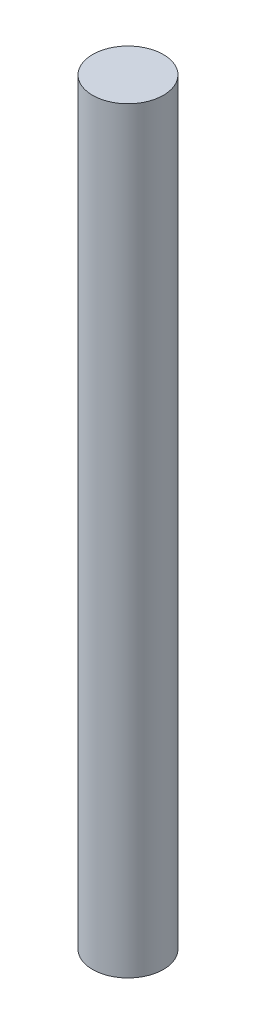
ISO-10303-21;
HEADER;
FILE_DESCRIPTION(('STEP AP214'),'2;1');
FILE_NAME('part.step','',(''),(''),'','','');
FILE_SCHEMA(('AUTOMOTIVE_DESIGN { 1 0 10303 214 1 1 1 1 }'));
ENDSEC;
DATA;
#1=APPLICATION_CONTEXT('core data for automotive mechanical design processes');
#2=APPLICATION_PROTOCOL_DEFINITION('international standard','automotive_design',2000,#1);
#3=PRODUCT_CONTEXT('',#1,'mechanical');
#4=PRODUCT('Part','Part','',(#3));
#5=PRODUCT_RELATED_PRODUCT_CATEGORY('part','',(#4));
#6=PRODUCT_DEFINITION_FORMATION('','',#4);
#7=PRODUCT_DEFINITION_CONTEXT('part definition',#1,'design');
#8=PRODUCT_DEFINITION('design','',#6,#7);
#9=PRODUCT_DEFINITION_SHAPE('','',#8);
#10=(LENGTH_UNIT() NAMED_UNIT(*) SI_UNIT(.MILLI.,.METRE.));
#11=(NAMED_UNIT(*) PLANE_ANGLE_UNIT() SI_UNIT($,.RADIAN.));
#12=(NAMED_UNIT(*) SI_UNIT($,.STERADIAN.) SOLID_ANGLE_UNIT());
#13=UNCERTAINTY_MEASURE_WITH_UNIT(LENGTH_MEASURE(1.E-05),#10,'distance_accuracy_value','');
#14=(GEOMETRIC_REPRESENTATION_CONTEXT(3) GLOBAL_UNCERTAINTY_ASSIGNED_CONTEXT((#13)) GLOBAL_UNIT_ASSIGNED_CONTEXT((#10,
#11,#12)) REPRESENTATION_CONTEXT('',''));
#15=CARTESIAN_POINT('',(0.,0.,0.));
#16=DIRECTION('',(0.,0.,1.));
#17=DIRECTION('',(1.,0.,0.));
#18=AXIS2_PLACEMENT_3D('',#15,#16,#17);
#19=CARTESIAN_POINT('',(0.,53.5,0.));
#20=DIRECTION('',(0.,-1.,0.));
#21=DIRECTION('',(0.,0.,-1.));
#22=AXIS2_PLACEMENT_3D('',#19,#20,#21);
#23=CYLINDRICAL_SURFACE('',#22,2.5);
#24=CARTESIAN_POINT('',(0.,53.5,0.));
#25=DIRECTION('',(0.,1.,0.));
#26=DIRECTION('',(0.,0.,1.));
#27=AXIS2_PLACEMENT_3D('',#24,#25,#26);
#28=CIRCLE('',#27,2.5);
#29=CARTESIAN_POINT('',(0.,53.5,2.5));
#30=VERTEX_POINT('',#29);
#31=EDGE_CURVE('E10',#30,#30,#28,.T.);
#32=ORIENTED_EDGE('',*,*,#31,.F.);
#33=EDGE_LOOP('',(#32));
#34=FACE_BOUND('',#33,.T.);
#35=CARTESIAN_POINT('',(0.,0.,0.));
#36=DIRECTION('',(0.,1.,0.));
#37=DIRECTION('',(0.,0.,1.));
#38=AXIS2_PLACEMENT_3D('',#35,#36,#37);
#39=CIRCLE('',#38,2.5);
#40=CARTESIAN_POINT('',(0.,0.,2.5));
#41=VERTEX_POINT('',#40);
#42=EDGE_CURVE('E42',#41,#41,#39,.T.);
#43=ORIENTED_EDGE('',*,*,#42,.T.);
#44=EDGE_LOOP('',(#43));
#45=FACE_BOUND('',#44,.T.);
#46=ADVANCED_FACE('F39',(#34,#45),#23,.T.);
#47=CARTESIAN_POINT('',(0.,53.5,0.));
#48=DIRECTION('',(0.,1.,0.));
#49=DIRECTION('',(0.,0.,1.));
#50=AXIS2_PLACEMENT_3D('',#47,#48,#49);
#51=PLANE('',#50);
#52=ORIENTED_EDGE('',*,*,#31,.T.);
#53=EDGE_LOOP('',(#52));
#54=FACE_BOUND('',#53,.T.);
#55=ADVANCED_FACE('F56',(#54),#51,.T.);
#56=CARTESIAN_POINT('',(0.,0.,0.));
#57=DIRECTION('',(0.,1.,0.));
#58=DIRECTION('',(0.,0.,1.));
#59=AXIS2_PLACEMENT_3D('',#56,#57,#58);
#60=PLANE('',#59);
#61=ORIENTED_EDGE('',*,*,#42,.F.);
#62=EDGE_LOOP('',(#61));
#63=FACE_BOUND('',#62,.T.);
#64=ADVANCED_FACE('F54',(#63),#60,.F.);
#65=CLOSED_SHELL('',(#46,#55,#64));
#66=MANIFOLD_SOLID_BREP('B2',#65);
#67=ADVANCED_BREP_SHAPE_REPRESENTATION('',(#18,#66),#14);
#68=SHAPE_DEFINITION_REPRESENTATION(#9,#67);
ENDSEC;
END-ISO-10303-21;
